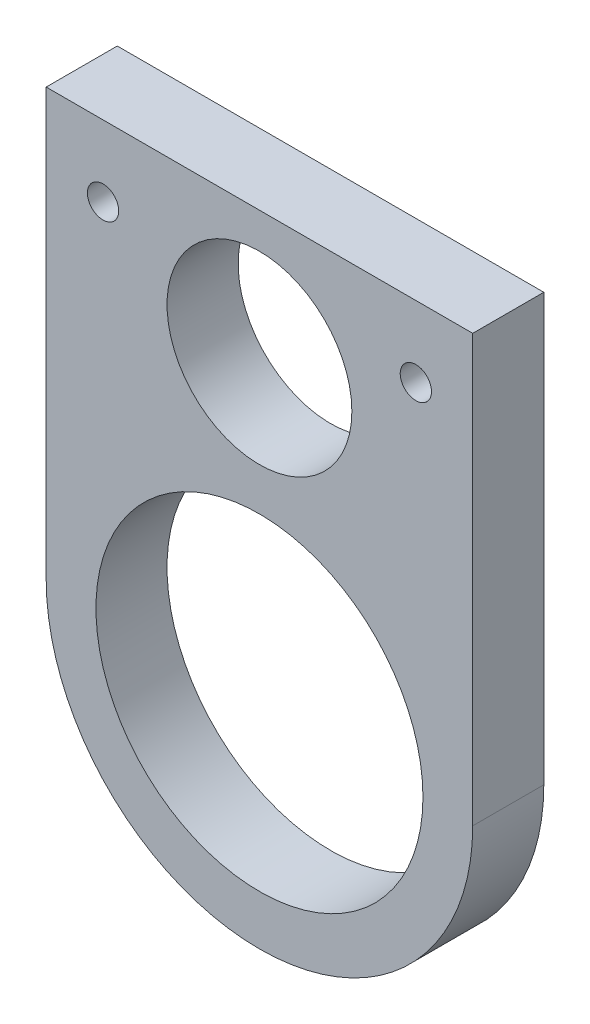
ISO-10303-21;
HEADER;
FILE_DESCRIPTION(('STEP AP214'),'2;1');
FILE_NAME('part.step','',(''),(''),'','','');
FILE_SCHEMA(('AUTOMOTIVE_DESIGN { 1 0 10303 214 1 1 1 1 }'));
ENDSEC;
DATA;
#1=APPLICATION_CONTEXT('core data for automotive mechanical design processes');
#2=APPLICATION_PROTOCOL_DEFINITION('international standard','automotive_design',2000,#1);
#3=PRODUCT_CONTEXT('',#1,'mechanical');
#4=PRODUCT('Part','Part','',(#3));
#5=PRODUCT_RELATED_PRODUCT_CATEGORY('part','',(#4));
#6=PRODUCT_DEFINITION_FORMATION('','',#4);
#7=PRODUCT_DEFINITION_CONTEXT('part definition',#1,'design');
#8=PRODUCT_DEFINITION('design','',#6,#7);
#9=PRODUCT_DEFINITION_SHAPE('','',#8);
#10=(LENGTH_UNIT() NAMED_UNIT(*) SI_UNIT(.MILLI.,.METRE.));
#11=(NAMED_UNIT(*) PLANE_ANGLE_UNIT() SI_UNIT($,.RADIAN.));
#12=(NAMED_UNIT(*) SI_UNIT($,.STERADIAN.) SOLID_ANGLE_UNIT());
#13=UNCERTAINTY_MEASURE_WITH_UNIT(LENGTH_MEASURE(1.E-05),#10,'distance_accuracy_value','');
#14=(GEOMETRIC_REPRESENTATION_CONTEXT(3) GLOBAL_UNCERTAINTY_ASSIGNED_CONTEXT((#13)) GLOBAL_UNIT_ASSIGNED_CONTEXT((#10,
#11,#12)) REPRESENTATION_CONTEXT('',''));
#15=CARTESIAN_POINT('',(0.,0.,0.));
#16=DIRECTION('',(0.,0.,1.));
#17=DIRECTION('',(1.,0.,0.));
#18=AXIS2_PLACEMENT_3D('',#15,#16,#17);
#19=CARTESIAN_POINT('',(0.,0.,6.35));
#20=DIRECTION('',(1.,0.,0.));
#21=DIRECTION('',(0.,1.,0.));
#22=AXIS2_PLACEMENT_3D('',#19,#20,#21);
#23=PLANE('',#22);
#24=DIRECTION('',(0.,-1.,0.));
#25=VECTOR('',#24,1.);
#26=CARTESIAN_POINT('',(0.,0.,0.));
#27=LINE('',#26,#25);
#28=CARTESIAN_POINT('',(0.,0.,0.));
#29=VERTEX_POINT('',#28);
#30=CARTESIAN_POINT('',(0.,-38.1,0.));
#31=VERTEX_POINT('',#30);
#32=EDGE_CURVE('E108',#29,#31,#27,.T.);
#33=ORIENTED_EDGE('',*,*,#32,.T.);
#34=DIRECTION('',(0.,0.,-1.));
#35=VECTOR('',#34,1.);
#36=CARTESIAN_POINT('',(0.,-38.1,6.35));
#37=LINE('',#36,#35);
#38=CARTESIAN_POINT('',(0.,-38.1,6.35));
#39=VERTEX_POINT('',#38);
#40=EDGE_CURVE('E11',#39,#31,#37,.T.);
#41=ORIENTED_EDGE('',*,*,#40,.F.);
#42=DIRECTION('',(0.,-1.,0.));
#43=VECTOR('',#42,1.);
#44=CARTESIAN_POINT('',(0.,0.,6.35));
#45=LINE('',#44,#43);
#46=CARTESIAN_POINT('',(0.,0.,6.35));
#47=VERTEX_POINT('',#46);
#48=EDGE_CURVE('E92',#47,#39,#45,.T.);
#49=ORIENTED_EDGE('',*,*,#48,.F.);
#50=DIRECTION('',(0.,0.,-1.));
#51=VECTOR('',#50,1.);
#52=CARTESIAN_POINT('',(0.,0.,6.35));
#53=LINE('',#52,#51);
#54=EDGE_CURVE('E104',#47,#29,#53,.T.);
#55=ORIENTED_EDGE('',*,*,#54,.T.);
#56=EDGE_LOOP('',(#33,#41,#49,#55));
#57=FACE_BOUND('',#56,.T.);
#58=ADVANCED_FACE('F40',(#57),#23,.F.);
#59=CARTESIAN_POINT('',(19.05,-38.1,6.35));
#60=DIRECTION('',(0.,0.,-1.));
#61=DIRECTION('',(-1.,0.,0.));
#62=AXIS2_PLACEMENT_3D('',#59,#60,#61);
#63=CYLINDRICAL_SURFACE('',#62,19.05);
#64=CARTESIAN_POINT('',(19.05,-38.1,0.));
#65=DIRECTION('',(0.,0.,1.));
#66=DIRECTION('',(1.,0.,0.));
#67=AXIS2_PLACEMENT_3D('',#64,#65,#66);
#68=CIRCLE('',#67,19.05);
#69=CARTESIAN_POINT('',(38.1,-38.1,0.));
#70=VERTEX_POINT('',#69);
#71=EDGE_CURVE('E97',#31,#70,#68,.T.);
#72=ORIENTED_EDGE('',*,*,#71,.T.);
#73=DIRECTION('',(0.,0.,-1.));
#74=VECTOR('',#73,1.);
#75=CARTESIAN_POINT('',(38.1,-38.1,6.35));
#76=LINE('',#75,#74);
#77=CARTESIAN_POINT('',(38.1,-38.1,6.35));
#78=VERTEX_POINT('',#77);
#79=EDGE_CURVE('E49',#78,#70,#76,.T.);
#80=ORIENTED_EDGE('',*,*,#79,.F.);
#81=CARTESIAN_POINT('',(19.05,-38.1,6.35));
#82=DIRECTION('',(0.,0.,1.));
#83=DIRECTION('',(1.,0.,0.));
#84=AXIS2_PLACEMENT_3D('',#81,#82,#83);
#85=CIRCLE('',#84,19.05);
#86=EDGE_CURVE('E87',#39,#78,#85,.T.);
#87=ORIENTED_EDGE('',*,*,#86,.F.);
#88=ORIENTED_EDGE('',*,*,#40,.T.);
#89=EDGE_LOOP('',(#72,#80,#87,#88));
#90=FACE_BOUND('',#89,.T.);
#91=ADVANCED_FACE('F96',(#90),#63,.T.);
#92=CARTESIAN_POINT('',(38.1,-38.1,6.35));
#93=DIRECTION('',(-1.,0.,0.));
#94=DIRECTION('',(0.,0.,1.));
#95=AXIS2_PLACEMENT_3D('',#92,#93,#94);
#96=PLANE('',#95);
#97=DIRECTION('',(0.,1.,0.));
#98=VECTOR('',#97,1.);
#99=CARTESIAN_POINT('',(38.1,-38.1,0.));
#100=LINE('',#99,#98);
#101=CARTESIAN_POINT('',(38.1,0.,0.));
#102=VERTEX_POINT('',#101);
#103=EDGE_CURVE('E74',#70,#102,#100,.T.);
#104=ORIENTED_EDGE('',*,*,#103,.T.);
#105=DIRECTION('',(0.,0.,-1.));
#106=VECTOR('',#105,1.);
#107=CARTESIAN_POINT('',(38.1,0.,6.35));
#108=LINE('',#107,#106);
#109=CARTESIAN_POINT('',(38.1,0.,6.35));
#110=VERTEX_POINT('',#109);
#111=EDGE_CURVE('E99',#110,#102,#108,.T.);
#112=ORIENTED_EDGE('',*,*,#111,.F.);
#113=DIRECTION('',(0.,1.,0.));
#114=VECTOR('',#113,1.);
#115=CARTESIAN_POINT('',(38.1,-38.1,6.35));
#116=LINE('',#115,#114);
#117=EDGE_CURVE('E90',#78,#110,#116,.T.);
#118=ORIENTED_EDGE('',*,*,#117,.F.);
#119=ORIENTED_EDGE('',*,*,#79,.T.);
#120=EDGE_LOOP('',(#104,#112,#118,#119));
#121=FACE_BOUND('',#120,.T.);
#122=ADVANCED_FACE('F100',(#121),#96,.F.);
#123=CARTESIAN_POINT('',(0.,0.,6.35));
#124=DIRECTION('',(0.,-1.,0.));
#125=DIRECTION('',(0.,0.,-1.));
#126=AXIS2_PLACEMENT_3D('',#123,#124,#125);
#127=PLANE('',#126);
#128=DIRECTION('',(-1.,0.,0.));
#129=VECTOR('',#128,1.);
#130=CARTESIAN_POINT('',(0.,0.,0.));
#131=LINE('',#130,#129);
#132=EDGE_CURVE('E80',#102,#29,#131,.T.);
#133=ORIENTED_EDGE('',*,*,#132,.T.);
#134=ORIENTED_EDGE('',*,*,#54,.F.);
#135=DIRECTION('',(-1.,0.,0.));
#136=VECTOR('',#135,1.);
#137=CARTESIAN_POINT('',(0.,0.,6.35));
#138=LINE('',#137,#136);
#139=EDGE_CURVE('E57',#110,#47,#138,.T.);
#140=ORIENTED_EDGE('',*,*,#139,.F.);
#141=ORIENTED_EDGE('',*,*,#111,.T.);
#142=EDGE_LOOP('',(#133,#134,#140,#141));
#143=FACE_BOUND('',#142,.T.);
#144=ADVANCED_FACE('F122',(#143),#127,.F.);
#145=CARTESIAN_POINT('',(19.05,-38.1,6.35));
#146=DIRECTION('',(0.,0.,1.));
#147=DIRECTION('',(1.,0.,0.));
#148=AXIS2_PLACEMENT_3D('',#145,#146,#147);
#149=PLANE('',#148);
#150=CARTESIAN_POINT('',(5.08,-6.35,6.35));
#151=DIRECTION('',(0.,0.,1.));
#152=DIRECTION('',(1.,0.,0.));
#153=AXIS2_PLACEMENT_3D('',#150,#151,#152);
#154=CIRCLE('',#153,1.397);
#155=CARTESIAN_POINT('',(6.477,-6.35,6.35));
#156=VERTEX_POINT('',#155);
#157=EDGE_CURVE('E153',#156,#156,#154,.T.);
#158=ORIENTED_EDGE('',*,*,#157,.F.);
#159=EDGE_LOOP('',(#158));
#160=FACE_BOUND('',#159,.T.);
#161=CARTESIAN_POINT('',(33.02,-6.35,6.35));
#162=DIRECTION('',(0.,0.,1.));
#163=DIRECTION('',(1.,0.,0.));
#164=AXIS2_PLACEMENT_3D('',#161,#162,#163);
#165=CIRCLE('',#164,1.39700000000001);
#166=CARTESIAN_POINT('',(34.417,-6.35,6.35));
#167=VERTEX_POINT('',#166);
#168=EDGE_CURVE('E145',#167,#167,#165,.T.);
#169=ORIENTED_EDGE('',*,*,#168,.F.);
#170=EDGE_LOOP('',(#169));
#171=FACE_BOUND('',#170,.T.);
#172=CARTESIAN_POINT('',(19.05,-11.43,6.35));
#173=DIRECTION('',(0.,0.,1.));
#174=DIRECTION('',(1.,0.,0.));
#175=AXIS2_PLACEMENT_3D('',#172,#173,#174);
#176=CIRCLE('',#175,8.255);
#177=CARTESIAN_POINT('',(27.305,-11.43,6.35));
#178=VERTEX_POINT('',#177);
#179=EDGE_CURVE('E137',#178,#178,#176,.T.);
#180=ORIENTED_EDGE('',*,*,#179,.F.);
#181=EDGE_LOOP('',(#180));
#182=FACE_BOUND('',#181,.T.);
#183=CARTESIAN_POINT('',(19.05,-38.1,6.35));
#184=DIRECTION('',(0.,0.,1.));
#185=DIRECTION('',(1.,0.,0.));
#186=AXIS2_PLACEMENT_3D('',#183,#184,#185);
#187=CIRCLE('',#186,14.605);
#188=CARTESIAN_POINT('',(33.655,-38.1,6.35));
#189=VERTEX_POINT('',#188);
#190=EDGE_CURVE('E129',#189,#189,#187,.T.);
#191=ORIENTED_EDGE('',*,*,#190,.F.);
#192=EDGE_LOOP('',(#191));
#193=FACE_BOUND('',#192,.T.);
#194=ORIENTED_EDGE('',*,*,#48,.T.);
#195=ORIENTED_EDGE('',*,*,#86,.T.);
#196=ORIENTED_EDGE('',*,*,#117,.T.);
#197=ORIENTED_EDGE('',*,*,#139,.T.);
#198=EDGE_LOOP('',(#194,#195,#196,#197));
#199=FACE_BOUND('',#198,.T.);
#200=ADVANCED_FACE('F88',(#160,#171,#182,#193,#199),#149,.T.);
#201=CARTESIAN_POINT('',(19.05,-38.1,0.));
#202=DIRECTION('',(0.,0.,1.));
#203=DIRECTION('',(1.,0.,0.));
#204=AXIS2_PLACEMENT_3D('',#201,#202,#203);
#205=PLANE('',#204);
#206=CARTESIAN_POINT('',(5.08,-6.35,0.));
#207=DIRECTION('',(0.,0.,1.));
#208=DIRECTION('',(1.,0.,0.));
#209=AXIS2_PLACEMENT_3D('',#206,#207,#208);
#210=CIRCLE('',#209,1.397);
#211=CARTESIAN_POINT('',(6.477,-6.35,0.));
#212=VERTEX_POINT('',#211);
#213=EDGE_CURVE('E141',#212,#212,#210,.T.);
#214=ORIENTED_EDGE('',*,*,#213,.T.);
#215=EDGE_LOOP('',(#214));
#216=FACE_BOUND('',#215,.T.);
#217=CARTESIAN_POINT('',(33.02,-6.35,0.));
#218=DIRECTION('',(0.,0.,1.));
#219=DIRECTION('',(1.,0.,0.));
#220=AXIS2_PLACEMENT_3D('',#217,#218,#219);
#221=CIRCLE('',#220,1.39700000000001);
#222=CARTESIAN_POINT('',(34.417,-6.35,0.));
#223=VERTEX_POINT('',#222);
#224=EDGE_CURVE('E149',#223,#223,#221,.T.);
#225=ORIENTED_EDGE('',*,*,#224,.T.);
#226=EDGE_LOOP('',(#225));
#227=FACE_BOUND('',#226,.T.);
#228=CARTESIAN_POINT('',(19.05,-11.43,0.));
#229=DIRECTION('',(0.,0.,1.));
#230=DIRECTION('',(1.,0.,0.));
#231=AXIS2_PLACEMENT_3D('',#228,#229,#230);
#232=CIRCLE('',#231,8.255);
#233=CARTESIAN_POINT('',(27.305,-11.43,0.));
#234=VERTEX_POINT('',#233);
#235=EDGE_CURVE('E133',#234,#234,#232,.T.);
#236=ORIENTED_EDGE('',*,*,#235,.T.);
#237=EDGE_LOOP('',(#236));
#238=FACE_BOUND('',#237,.T.);
#239=CARTESIAN_POINT('',(19.05,-38.1,0.));
#240=DIRECTION('',(0.,0.,1.));
#241=DIRECTION('',(1.,0.,0.));
#242=AXIS2_PLACEMENT_3D('',#239,#240,#241);
#243=CIRCLE('',#242,14.605);
#244=CARTESIAN_POINT('',(33.655,-38.1,0.));
#245=VERTEX_POINT('',#244);
#246=EDGE_CURVE('E112',#245,#245,#243,.T.);
#247=ORIENTED_EDGE('',*,*,#246,.T.);
#248=EDGE_LOOP('',(#247));
#249=FACE_BOUND('',#248,.T.);
#250=ORIENTED_EDGE('',*,*,#32,.F.);
#251=ORIENTED_EDGE('',*,*,#132,.F.);
#252=ORIENTED_EDGE('',*,*,#103,.F.);
#253=ORIENTED_EDGE('',*,*,#71,.F.);
#254=EDGE_LOOP('',(#250,#251,#252,#253));
#255=FACE_BOUND('',#254,.T.);
#256=ADVANCED_FACE('F125',(#216,#227,#238,#249,#255),#205,.F.);
#257=CARTESIAN_POINT('',(19.05,-38.1,0.));
#258=DIRECTION('',(0.,0.,1.));
#259=DIRECTION('',(1.,0.,0.));
#260=AXIS2_PLACEMENT_3D('',#257,#258,#259);
#261=CYLINDRICAL_SURFACE('',#260,14.605);
#262=ORIENTED_EDGE('',*,*,#246,.F.);
#263=EDGE_LOOP('',(#262));
#264=FACE_BOUND('',#263,.T.);
#265=ORIENTED_EDGE('',*,*,#190,.T.);
#266=EDGE_LOOP('',(#265));
#267=FACE_BOUND('',#266,.T.);
#268=ADVANCED_FACE('F179',(#264,#267),#261,.F.);
#269=CARTESIAN_POINT('',(19.05,-11.43,0.));
#270=DIRECTION('',(0.,0.,1.));
#271=DIRECTION('',(1.,0.,0.));
#272=AXIS2_PLACEMENT_3D('',#269,#270,#271);
#273=CYLINDRICAL_SURFACE('',#272,8.255);
#274=ORIENTED_EDGE('',*,*,#235,.F.);
#275=EDGE_LOOP('',(#274));
#276=FACE_BOUND('',#275,.T.);
#277=ORIENTED_EDGE('',*,*,#179,.T.);
#278=EDGE_LOOP('',(#277));
#279=FACE_BOUND('',#278,.T.);
#280=ADVANCED_FACE('F181',(#276,#279),#273,.F.);
#281=CARTESIAN_POINT('',(33.02,-6.35,0.));
#282=DIRECTION('',(0.,0.,1.));
#283=DIRECTION('',(1.,0.,0.));
#284=AXIS2_PLACEMENT_3D('',#281,#282,#283);
#285=CYLINDRICAL_SURFACE('',#284,1.39700000000001);
#286=ORIENTED_EDGE('',*,*,#224,.F.);
#287=EDGE_LOOP('',(#286));
#288=FACE_BOUND('',#287,.T.);
#289=ORIENTED_EDGE('',*,*,#168,.T.);
#290=EDGE_LOOP('',(#289));
#291=FACE_BOUND('',#290,.T.);
#292=ADVANCED_FACE('F166',(#288,#291),#285,.F.);
#293=CARTESIAN_POINT('',(5.08,-6.35,0.));
#294=DIRECTION('',(0.,0.,1.));
#295=DIRECTION('',(1.,0.,0.));
#296=AXIS2_PLACEMENT_3D('',#293,#294,#295);
#297=CYLINDRICAL_SURFACE('',#296,1.397);
#298=ORIENTED_EDGE('',*,*,#213,.F.);
#299=EDGE_LOOP('',(#298));
#300=FACE_BOUND('',#299,.T.);
#301=ORIENTED_EDGE('',*,*,#157,.T.);
#302=EDGE_LOOP('',(#301));
#303=FACE_BOUND('',#302,.T.);
#304=ADVANCED_FACE('F163',(#300,#303),#297,.F.);
#305=CLOSED_SHELL('',(#58,#91,#122,#144,#200,#256,#268,#280,#292,#304));
#306=MANIFOLD_SOLID_BREP('B2',#305);
#307=ADVANCED_BREP_SHAPE_REPRESENTATION('',(#18,#306),#14);
#308=SHAPE_DEFINITION_REPRESENTATION(#9,#307);
ENDSEC;
END-ISO-10303-21;
